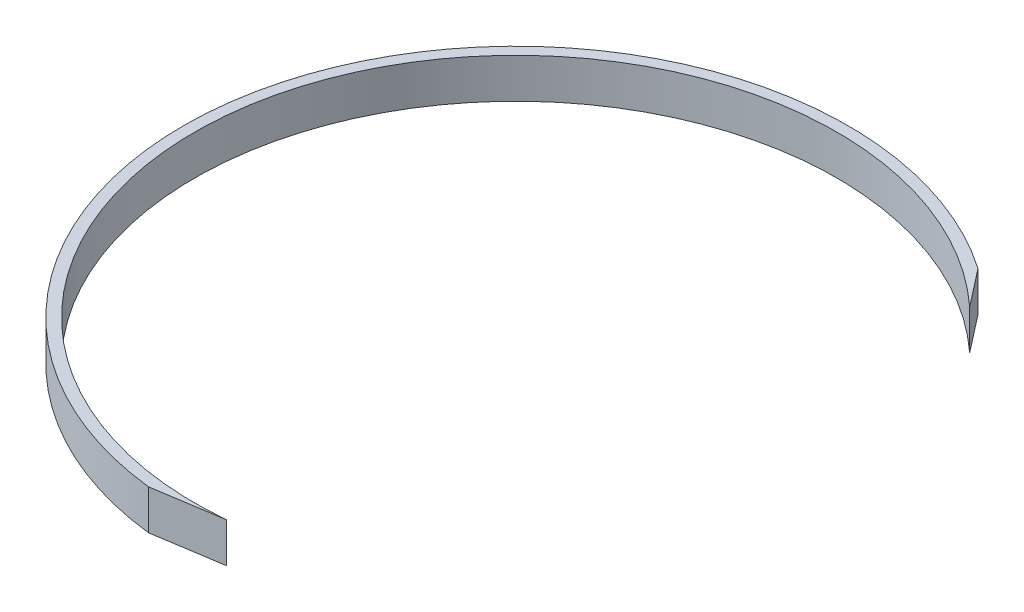
ISO-10303-21;
HEADER;
FILE_DESCRIPTION(('STEP AP214'),'2;1');
FILE_NAME('part.step','',(''),(''),'','','');
FILE_SCHEMA(('AUTOMOTIVE_DESIGN { 1 0 10303 214 1 1 1 1 }'));
ENDSEC;
DATA;
#1=APPLICATION_CONTEXT('core data for automotive mechanical design processes');
#2=APPLICATION_PROTOCOL_DEFINITION('international standard','automotive_design',2000,#1);
#3=PRODUCT_CONTEXT('',#1,'mechanical');
#4=PRODUCT('Part','Part','',(#3));
#5=PRODUCT_RELATED_PRODUCT_CATEGORY('part','',(#4));
#6=PRODUCT_DEFINITION_FORMATION('','',#4);
#7=PRODUCT_DEFINITION_CONTEXT('part definition',#1,'design');
#8=PRODUCT_DEFINITION('design','',#6,#7);
#9=PRODUCT_DEFINITION_SHAPE('','',#8);
#10=(LENGTH_UNIT() NAMED_UNIT(*) SI_UNIT(.MILLI.,.METRE.));
#11=(NAMED_UNIT(*) PLANE_ANGLE_UNIT() SI_UNIT($,.RADIAN.));
#12=(NAMED_UNIT(*) SI_UNIT($,.STERADIAN.) SOLID_ANGLE_UNIT());
#13=UNCERTAINTY_MEASURE_WITH_UNIT(LENGTH_MEASURE(1.E-05),#10,'distance_accuracy_value','');
#14=(GEOMETRIC_REPRESENTATION_CONTEXT(3) GLOBAL_UNCERTAINTY_ASSIGNED_CONTEXT((#13)) GLOBAL_UNIT_ASSIGNED_CONTEXT((#10,
#11,#12)) REPRESENTATION_CONTEXT('',''));
#15=CARTESIAN_POINT('',(0.,0.,0.));
#16=DIRECTION('',(0.,0.,1.));
#17=DIRECTION('',(1.,0.,0.));
#18=AXIS2_PLACEMENT_3D('',#15,#16,#17);
#19=CARTESIAN_POINT('',(145.719440182729,10.,-180.148984957569));
#20=DIRECTION('',(0.,-1.,0.));
#21=DIRECTION('',(0.,0.,-1.));
#22=AXIS2_PLACEMENT_3D('',#19,#20,#21);
#23=CYLINDRICAL_SURFACE('',#22,80.7042354867868);
#24=CARTESIAN_POINT('',(145.719440182729,0.,-180.148984957569));
#25=DIRECTION('',(0.,-1.,0.));
#26=DIRECTION('',(0.,0.,1.));
#27=AXIS2_PLACEMENT_3D('',#24,#25,#26);
#28=CIRCLE('',#27,80.7042354867868);
#29=CARTESIAN_POINT('',(153.420850697931,0.,-99.8130533853077));
#30=VERTEX_POINT('',#29);
#31=CARTESIAN_POINT('',(200.433414000458,0.,-239.474819924972));
#32=VERTEX_POINT('',#31);
#33=EDGE_CURVE('E93',#30,#32,#28,.T.);
#34=ORIENTED_EDGE('',*,*,#33,.T.);
#35=DIRECTION('',(0.,-1.,0.));
#36=VECTOR('',#35,1.);
#37=CARTESIAN_POINT('',(200.433414000458,10.,-239.474819924972));
#38=LINE('',#37,#36);
#39=CARTESIAN_POINT('',(200.433414000458,10.,-239.474819924972));
#40=VERTEX_POINT('',#39);
#41=EDGE_CURVE('E11',#40,#32,#38,.T.);
#42=ORIENTED_EDGE('',*,*,#41,.F.);
#43=CARTESIAN_POINT('',(145.719440182729,10.,-180.148984957569));
#44=DIRECTION('',(0.,-1.,0.));
#45=DIRECTION('',(0.,0.,1.));
#46=AXIS2_PLACEMENT_3D('',#43,#44,#45);
#47=CIRCLE('',#46,80.7042354867868);
#48=CARTESIAN_POINT('',(153.420850697931,10.,-99.8130533853077));
#49=VERTEX_POINT('',#48);
#50=EDGE_CURVE('E81',#49,#40,#47,.T.);
#51=ORIENTED_EDGE('',*,*,#50,.F.);
#52=DIRECTION('',(0.,-1.,0.));
#53=VECTOR('',#52,1.);
#54=CARTESIAN_POINT('',(153.420850697931,10.,-99.8130533853077));
#55=LINE('',#54,#53);
#56=EDGE_CURVE('E89',#49,#30,#55,.T.);
#57=ORIENTED_EDGE('',*,*,#56,.T.);
#58=EDGE_LOOP('',(#34,#42,#51,#57));
#59=FACE_BOUND('',#58,.T.);
#60=ADVANCED_FACE('F30',(#59),#23,.F.);
#61=CARTESIAN_POINT('',(200.433414000458,10.,-239.474819924972));
#62=DIRECTION('',(-0.789350449055262,0.,0.613942887063818));
#63=DIRECTION('',(0.613942887063818,0.,0.789350449055262));
#64=AXIS2_PLACEMENT_3D('',#61,#62,#63);
#65=PLANE('',#64);
#66=DIRECTION('',(-0.613942887063818,0.,-0.789350449055262));
#67=VECTOR('',#66,1.);
#68=CARTESIAN_POINT('',(200.433414000458,0.,-239.474819924972));
#69=LINE('',#68,#67);
#70=CARTESIAN_POINT('',(193.106684051832,0.,-248.894845300157));
#71=VERTEX_POINT('',#70);
#72=EDGE_CURVE('E85',#32,#71,#69,.T.);
#73=ORIENTED_EDGE('',*,*,#72,.T.);
#74=DIRECTION('',(0.,-1.,0.));
#75=VECTOR('',#74,1.);
#76=CARTESIAN_POINT('',(193.106684051832,10.,-248.894845300157));
#77=LINE('',#76,#75);
#78=CARTESIAN_POINT('',(193.106684051832,10.,-248.894845300157));
#79=VERTEX_POINT('',#78);
#80=EDGE_CURVE('E38',#79,#71,#77,.T.);
#81=ORIENTED_EDGE('',*,*,#80,.F.);
#82=DIRECTION('',(-0.613942887063818,0.,-0.789350449055262));
#83=VECTOR('',#82,1.);
#84=CARTESIAN_POINT('',(200.433414000458,10.,-239.474819924972));
#85=LINE('',#84,#83);
#86=EDGE_CURVE('E76',#40,#79,#85,.T.);
#87=ORIENTED_EDGE('',*,*,#86,.F.);
#88=ORIENTED_EDGE('',*,*,#41,.T.);
#89=EDGE_LOOP('',(#73,#81,#87,#88));
#90=FACE_BOUND('',#89,.T.);
#91=ADVANCED_FACE('F84',(#90),#65,.F.);
#92=CARTESIAN_POINT('',(145.719440182729,10.,-180.148984957569));
#93=DIRECTION('',(0.,-1.,0.));
#94=DIRECTION('',(0.,0.,-1.));
#95=AXIS2_PLACEMENT_3D('',#92,#93,#94);
#96=CYLINDRICAL_SURFACE('',#95,83.4957735202948);
#97=CARTESIAN_POINT('',(145.719440182729,0.,-180.148984957569));
#98=DIRECTION('',(0.,1.,0.));
#99=DIRECTION('',(0.,0.,1.));
#100=AXIS2_PLACEMENT_3D('',#97,#98,#99);
#101=CIRCLE('',#100,83.4957735202948);
#102=CARTESIAN_POINT('',(136.417150695796,0.,-97.1730149056701));
#103=VERTEX_POINT('',#102);
#104=EDGE_CURVE('E63',#71,#103,#101,.T.);
#105=ORIENTED_EDGE('',*,*,#104,.T.);
#106=DIRECTION('',(0.,-1.,0.));
#107=VECTOR('',#106,1.);
#108=CARTESIAN_POINT('',(136.417150695796,10.,-97.1730149056701));
#109=LINE('',#108,#107);
#110=CARTESIAN_POINT('',(136.417150695796,10.,-97.1730149056701));
#111=VERTEX_POINT('',#110);
#112=EDGE_CURVE('E86',#111,#103,#109,.T.);
#113=ORIENTED_EDGE('',*,*,#112,.F.);
#114=CARTESIAN_POINT('',(145.719440182729,10.,-180.148984957569));
#115=DIRECTION('',(0.,1.,0.));
#116=DIRECTION('',(0.,0.,1.));
#117=AXIS2_PLACEMENT_3D('',#114,#115,#116);
#118=CIRCLE('',#117,83.4957735202948);
#119=EDGE_CURVE('E79',#79,#111,#118,.T.);
#120=ORIENTED_EDGE('',*,*,#119,.F.);
#121=ORIENTED_EDGE('',*,*,#80,.T.);
#122=EDGE_LOOP('',(#105,#113,#120,#121));
#123=FACE_BOUND('',#122,.T.);
#124=ADVANCED_FACE('F87',(#123),#96,.T.);
#125=CARTESIAN_POINT('',(136.417150695796,10.,-97.1730149056701));
#126=DIRECTION('',(-0.153424341379068,0.,-0.988160397644228));
#127=DIRECTION('',(-0.988160397644228,0.,0.153424341379068));
#128=AXIS2_PLACEMENT_3D('',#125,#126,#127);
#129=PLANE('',#128);
#130=DIRECTION('',(0.988160397644228,0.,-0.153424341379068));
#131=VECTOR('',#130,1.);
#132=CARTESIAN_POINT('',(136.417150695796,0.,-97.1730149056701));
#133=LINE('',#132,#131);
#134=EDGE_CURVE('E69',#103,#30,#133,.T.);
#135=ORIENTED_EDGE('',*,*,#134,.T.);
#136=ORIENTED_EDGE('',*,*,#56,.F.);
#137=DIRECTION('',(0.988160397644228,0.,-0.153424341379068));
#138=VECTOR('',#137,1.);
#139=CARTESIAN_POINT('',(136.417150695796,10.,-97.1730149056701));
#140=LINE('',#139,#138);
#141=EDGE_CURVE('E46',#111,#49,#140,.T.);
#142=ORIENTED_EDGE('',*,*,#141,.F.);
#143=ORIENTED_EDGE('',*,*,#112,.T.);
#144=EDGE_LOOP('',(#135,#136,#142,#143));
#145=FACE_BOUND('',#144,.T.);
#146=ADVANCED_FACE('F100',(#145),#129,.F.);
#147=CARTESIAN_POINT('',(145.719440182729,10.,-180.148984957569));
#148=DIRECTION('',(0.,1.,0.));
#149=DIRECTION('',(0.,0.,1.));
#150=AXIS2_PLACEMENT_3D('',#147,#148,#149);
#151=PLANE('',#150);
#152=ORIENTED_EDGE('',*,*,#50,.T.);
#153=ORIENTED_EDGE('',*,*,#86,.T.);
#154=ORIENTED_EDGE('',*,*,#119,.T.);
#155=ORIENTED_EDGE('',*,*,#141,.T.);
#156=EDGE_LOOP('',(#152,#153,#154,#155));
#157=FACE_BOUND('',#156,.T.);
#158=ADVANCED_FACE('F77',(#157),#151,.T.);
#159=CARTESIAN_POINT('',(145.719440182729,0.,-180.148984957569));
#160=DIRECTION('',(0.,1.,0.));
#161=DIRECTION('',(0.,0.,1.));
#162=AXIS2_PLACEMENT_3D('',#159,#160,#161);
#163=PLANE('',#162);
#164=ORIENTED_EDGE('',*,*,#33,.F.);
#165=ORIENTED_EDGE('',*,*,#134,.F.);
#166=ORIENTED_EDGE('',*,*,#104,.F.);
#167=ORIENTED_EDGE('',*,*,#72,.F.);
#168=EDGE_LOOP('',(#164,#165,#166,#167));
#169=FACE_BOUND('',#168,.T.);
#170=ADVANCED_FACE('F103',(#169),#163,.F.);
#171=CLOSED_SHELL('',(#60,#91,#124,#146,#158,#170));
#172=MANIFOLD_SOLID_BREP('B2',#171);
#173=ADVANCED_BREP_SHAPE_REPRESENTATION('',(#18,#172),#14);
#174=SHAPE_DEFINITION_REPRESENTATION(#9,#173);
ENDSEC;
END-ISO-10303-21;
